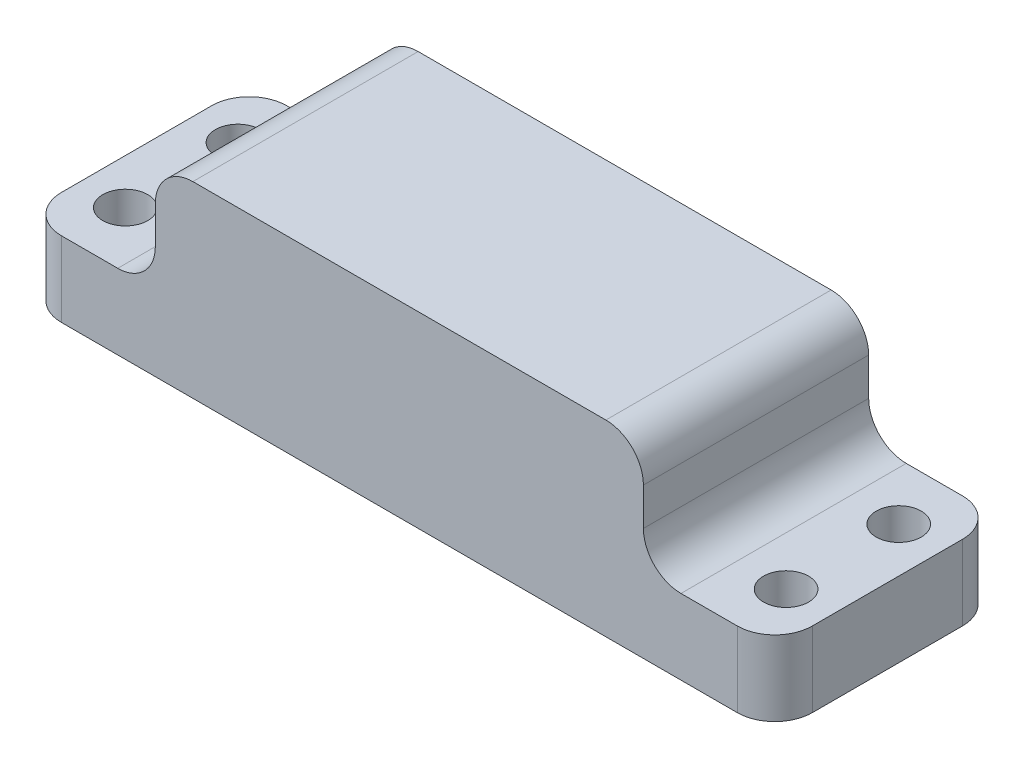
ISO-10303-21;
HEADER;
FILE_DESCRIPTION(('STEP AP214'),'2;1');
FILE_NAME('part.step','',(''),(''),'','','');
FILE_SCHEMA(('AUTOMOTIVE_DESIGN { 1 0 10303 214 1 1 1 1 }'));
ENDSEC;
DATA;
#1=APPLICATION_CONTEXT('core data for automotive mechanical design processes');
#2=APPLICATION_PROTOCOL_DEFINITION('international standard','automotive_design',2000,#1);
#3=PRODUCT_CONTEXT('',#1,'mechanical');
#4=PRODUCT('Part','Part','',(#3));
#5=PRODUCT_RELATED_PRODUCT_CATEGORY('part','',(#4));
#6=PRODUCT_DEFINITION_FORMATION('','',#4);
#7=PRODUCT_DEFINITION_CONTEXT('part definition',#1,'design');
#8=PRODUCT_DEFINITION('design','',#6,#7);
#9=PRODUCT_DEFINITION_SHAPE('','',#8);
#10=(LENGTH_UNIT() NAMED_UNIT(*) SI_UNIT(.MILLI.,.METRE.));
#11=(NAMED_UNIT(*) PLANE_ANGLE_UNIT() SI_UNIT($,.RADIAN.));
#12=(NAMED_UNIT(*) SI_UNIT($,.STERADIAN.) SOLID_ANGLE_UNIT());
#13=UNCERTAINTY_MEASURE_WITH_UNIT(LENGTH_MEASURE(1.E-05),#10,'distance_accuracy_value','');
#14=(GEOMETRIC_REPRESENTATION_CONTEXT(3) GLOBAL_UNCERTAINTY_ASSIGNED_CONTEXT((#13)) GLOBAL_UNIT_ASSIGNED_CONTEXT((#10,
#11,#12)) REPRESENTATION_CONTEXT('',''));
#15=CARTESIAN_POINT('',(0.,0.,0.));
#16=DIRECTION('',(0.,0.,1.));
#17=DIRECTION('',(1.,0.,0.));
#18=AXIS2_PLACEMENT_3D('',#15,#16,#17);
#19=CARTESIAN_POINT('',(-67.372881355932,54.5762711864407,60.));
#20=DIRECTION('',(0.,0.,-1.));
#21=DIRECTION('',(-1.,0.,0.));
#22=AXIS2_PLACEMENT_3D('',#19,#20,#21);
#23=CYLINDRICAL_SURFACE('',#22,9.99999999999999);
#24=CARTESIAN_POINT('',(-67.372881355932,54.5762711864407,0.));
#25=DIRECTION('',(0.,0.,1.));
#26=DIRECTION('',(1.,0.,0.));
#27=AXIS2_PLACEMENT_3D('',#24,#25,#26);
#28=CIRCLE('',#27,9.99999999999999);
#29=CARTESIAN_POINT('',(-67.372881355932,64.5762711864407,0.));
#30=VERTEX_POINT('',#29);
#31=CARTESIAN_POINT('',(-77.372881355932,54.5762711864407,0.));
#32=VERTEX_POINT('',#31);
#33=EDGE_CURVE('E176',#30,#32,#28,.T.);
#34=ORIENTED_EDGE('',*,*,#33,.T.);
#35=DIRECTION('',(0.,0.,-1.));
#36=VECTOR('',#35,1.);
#37=CARTESIAN_POINT('',(-77.372881355932,54.5762711864407,60.));
#38=LINE('',#37,#36);
#39=CARTESIAN_POINT('',(-77.372881355932,54.5762711864407,60.));
#40=VERTEX_POINT('',#39);
#41=EDGE_CURVE('E174',#40,#32,#38,.T.);
#42=ORIENTED_EDGE('',*,*,#41,.F.);
#43=CARTESIAN_POINT('',(-67.372881355932,54.5762711864407,60.));
#44=DIRECTION('',(0.,0.,1.));
#45=DIRECTION('',(1.,0.,0.));
#46=AXIS2_PLACEMENT_3D('',#43,#44,#45);
#47=CIRCLE('',#46,9.99999999999999);
#48=CARTESIAN_POINT('',(-67.372881355932,64.5762711864407,60.));
#49=VERTEX_POINT('',#48);
#50=EDGE_CURVE('E158',#49,#40,#47,.T.);
#51=ORIENTED_EDGE('',*,*,#50,.F.);
#52=DIRECTION('',(0.,0.,-1.));
#53=VECTOR('',#52,1.);
#54=CARTESIAN_POINT('',(-67.372881355932,64.5762711864407,60.));
#55=LINE('',#54,#53);
#56=EDGE_CURVE('E216',#49,#30,#55,.T.);
#57=ORIENTED_EDGE('',*,*,#56,.T.);
#58=EDGE_LOOP('',(#34,#42,#51,#57));
#59=FACE_BOUND('',#58,.T.);
#60=ADVANCED_FACE('F43',(#59),#23,.T.);
#61=CARTESIAN_POINT('',(-77.372881355932,44.5762711864408,60.));
#62=DIRECTION('',(-1.,0.,0.));
#63=DIRECTION('',(0.,0.,1.));
#64=AXIS2_PLACEMENT_3D('',#61,#62,#63);
#65=PLANE('',#64);
#66=DIRECTION('',(0.,1.,0.));
#67=VECTOR('',#66,1.);
#68=CARTESIAN_POINT('',(-77.372881355932,44.5762711864408,0.));
#69=LINE('',#68,#67);
#70=CARTESIAN_POINT('',(-77.372881355932,44.5762711864407,0.));
#71=VERTEX_POINT('',#70);
#72=EDGE_CURVE('E219',#71,#32,#69,.T.);
#73=ORIENTED_EDGE('',*,*,#72,.F.);
#74=DIRECTION('',(0.,0.,-1.));
#75=VECTOR('',#74,1.);
#76=CARTESIAN_POINT('',(-77.372881355932,44.5762711864407,60.));
#77=LINE('',#76,#75);
#78=CARTESIAN_POINT('',(-77.372881355932,44.5762711864407,60.));
#79=VERTEX_POINT('',#78);
#80=EDGE_CURVE('E182',#79,#71,#77,.T.);
#81=ORIENTED_EDGE('',*,*,#80,.F.);
#82=DIRECTION('',(0.,1.,0.));
#83=VECTOR('',#82,1.);
#84=CARTESIAN_POINT('',(-77.372881355932,44.5762711864408,60.));
#85=LINE('',#84,#83);
#86=EDGE_CURVE('E164',#79,#40,#85,.T.);
#87=ORIENTED_EDGE('',*,*,#86,.T.);
#88=ORIENTED_EDGE('',*,*,#41,.T.);
#89=EDGE_LOOP('',(#73,#81,#87,#88));
#90=FACE_BOUND('',#89,.T.);
#91=ADVANCED_FACE('F184',(#90),#65,.T.);
#92=CARTESIAN_POINT('',(-87.372881355932,44.5762711864407,60.));
#93=DIRECTION('',(0.,0.,-1.));
#94=DIRECTION('',(-1.,0.,0.));
#95=AXIS2_PLACEMENT_3D('',#92,#93,#94);
#96=CYLINDRICAL_SURFACE('',#95,10.);
#97=CARTESIAN_POINT('',(-87.372881355932,44.5762711864407,0.));
#98=DIRECTION('',(0.,0.,1.));
#99=DIRECTION('',(1.,0.,0.));
#100=AXIS2_PLACEMENT_3D('',#97,#98,#99);
#101=CIRCLE('',#100,10.);
#102=CARTESIAN_POINT('',(-87.3728813559321,34.5762711864407,0.));
#103=VERTEX_POINT('',#102);
#104=EDGE_CURVE('E223',#103,#71,#101,.T.);
#105=ORIENTED_EDGE('',*,*,#104,.F.);
#106=DIRECTION('',(0.,0.,-1.));
#107=VECTOR('',#106,1.);
#108=CARTESIAN_POINT('',(-87.3728813559321,34.5762711864407,60.));
#109=LINE('',#108,#107);
#110=CARTESIAN_POINT('',(-87.3728813559321,34.5762711864407,60.));
#111=VERTEX_POINT('',#110);
#112=EDGE_CURVE('E281',#111,#103,#109,.T.);
#113=ORIENTED_EDGE('',*,*,#112,.F.);
#114=CARTESIAN_POINT('',(-87.372881355932,44.5762711864407,60.));
#115=DIRECTION('',(0.,0.,1.));
#116=DIRECTION('',(1.,0.,0.));
#117=AXIS2_PLACEMENT_3D('',#114,#115,#116);
#118=CIRCLE('',#117,10.);
#119=EDGE_CURVE('E186',#111,#79,#118,.T.);
#120=ORIENTED_EDGE('',*,*,#119,.T.);
#121=ORIENTED_EDGE('',*,*,#80,.T.);
#122=EDGE_LOOP('',(#105,#113,#120,#121));
#123=FACE_BOUND('',#122,.T.);
#124=ADVANCED_FACE('F368',(#123),#96,.F.);
#125=CARTESIAN_POINT('',(-112.372881355932,34.5762711864407,60.));
#126=DIRECTION('',(0.,1.,0.));
#127=DIRECTION('',(0.,0.,1.));
#128=AXIS2_PLACEMENT_3D('',#125,#126,#127);
#129=PLANE('',#128);
#130=CARTESIAN_POINT('',(-100.372881355932,34.5762711864407,15.));
#131=DIRECTION('',(0.,1.,0.));
#132=DIRECTION('',(0.,0.,1.));
#133=AXIS2_PLACEMENT_3D('',#130,#131,#132);
#134=CIRCLE('',#133,5.99999999999999);
#135=CARTESIAN_POINT('',(-100.372881355932,34.5762711864407,21.));
#136=VERTEX_POINT('',#135);
#137=EDGE_CURVE('E512',#136,#136,#134,.T.);
#138=ORIENTED_EDGE('',*,*,#137,.F.);
#139=EDGE_LOOP('',(#138));
#140=FACE_BOUND('',#139,.T.);
#141=CARTESIAN_POINT('',(-100.372881355932,34.5762711864407,45.));
#142=DIRECTION('',(0.,1.,0.));
#143=DIRECTION('',(0.,0.,1.));
#144=AXIS2_PLACEMENT_3D('',#141,#142,#143);
#145=CIRCLE('',#144,5.99999999999999);
#146=CARTESIAN_POINT('',(-100.372881355932,34.5762711864407,51.));
#147=VERTEX_POINT('',#146);
#148=EDGE_CURVE('E498',#147,#147,#145,.T.);
#149=ORIENTED_EDGE('',*,*,#148,.F.);
#150=EDGE_LOOP('',(#149));
#151=FACE_BOUND('',#150,.T.);
#152=DIRECTION('',(1.,0.,0.));
#153=VECTOR('',#152,1.);
#154=CARTESIAN_POINT('',(-112.372881355932,34.5762711864407,0.));
#155=LINE('',#154,#153);
#156=CARTESIAN_POINT('',(-102.372881355932,34.5762711864407,0.));
#157=VERTEX_POINT('',#156);
#158=EDGE_CURVE('E227',#157,#103,#155,.T.);
#159=ORIENTED_EDGE('',*,*,#158,.F.);
#160=CARTESIAN_POINT('',(-102.372881355932,34.5762711864407,10.));
#161=DIRECTION('',(0.,1.,0.));
#162=DIRECTION('',(0.,0.,1.));
#163=AXIS2_PLACEMENT_3D('',#160,#161,#162);
#164=CIRCLE('',#163,10.);
#165=CARTESIAN_POINT('',(-112.372881355932,34.5762711864407,10.));
#166=VERTEX_POINT('',#165);
#167=EDGE_CURVE('E297',#157,#166,#164,.T.);
#168=ORIENTED_EDGE('',*,*,#167,.T.);
#169=DIRECTION('',(0.,0.,-1.));
#170=VECTOR('',#169,1.);
#171=CARTESIAN_POINT('',(-112.372881355932,34.5762711864407,60.));
#172=LINE('',#171,#170);
#173=CARTESIAN_POINT('',(-112.372881355932,34.5762711864407,50.));
#174=VERTEX_POINT('',#173);
#175=EDGE_CURVE('E277',#174,#166,#172,.T.);
#176=ORIENTED_EDGE('',*,*,#175,.F.);
#177=CARTESIAN_POINT('',(-102.372881355932,34.5762711864407,50.));
#178=DIRECTION('',(0.,1.,0.));
#179=DIRECTION('',(0.,0.,1.));
#180=AXIS2_PLACEMENT_3D('',#177,#178,#179);
#181=CIRCLE('',#180,10.);
#182=CARTESIAN_POINT('',(-102.372881355932,34.5762711864407,60.));
#183=VERTEX_POINT('',#182);
#184=EDGE_CURVE('E294',#174,#183,#181,.T.);
#185=ORIENTED_EDGE('',*,*,#184,.T.);
#186=DIRECTION('',(1.,0.,0.));
#187=VECTOR('',#186,1.);
#188=CARTESIAN_POINT('',(-112.372881355932,34.5762711864407,60.));
#189=LINE('',#188,#187);
#190=EDGE_CURVE('E189',#183,#111,#189,.T.);
#191=ORIENTED_EDGE('',*,*,#190,.T.);
#192=ORIENTED_EDGE('',*,*,#112,.T.);
#193=EDGE_LOOP('',(#159,#168,#176,#185,#191,#192));
#194=FACE_BOUND('',#193,.T.);
#195=ADVANCED_FACE('F383',(#140,#151,#194),#129,.T.);
#196=CARTESIAN_POINT('',(-112.372881355932,14.5762711864407,60.));
#197=DIRECTION('',(-1.,0.,0.));
#198=DIRECTION('',(0.,0.,1.));
#199=AXIS2_PLACEMENT_3D('',#196,#197,#198);
#200=PLANE('',#199);
#201=ORIENTED_EDGE('',*,*,#175,.T.);
#202=DIRECTION('',(0.,1.,0.));
#203=VECTOR('',#202,1.);
#204=CARTESIAN_POINT('',(-112.372881355932,14.5762711864407,10.));
#205=LINE('',#204,#203);
#206=CARTESIAN_POINT('',(-112.372881355932,14.5762711864407,10.));
#207=VERTEX_POINT('',#206);
#208=EDGE_CURVE('E304',#166,#207,#205,.F.);
#209=ORIENTED_EDGE('',*,*,#208,.T.);
#210=DIRECTION('',(0.,0.,-1.));
#211=VECTOR('',#210,1.);
#212=CARTESIAN_POINT('',(-112.372881355932,14.5762711864407,60.));
#213=LINE('',#212,#211);
#214=CARTESIAN_POINT('',(-112.372881355932,14.5762711864407,50.));
#215=VERTEX_POINT('',#214);
#216=EDGE_CURVE('E273',#215,#207,#213,.T.);
#217=ORIENTED_EDGE('',*,*,#216,.F.);
#218=DIRECTION('',(0.,1.,0.));
#219=VECTOR('',#218,1.);
#220=CARTESIAN_POINT('',(-112.372881355932,14.5762711864407,50.));
#221=LINE('',#220,#219);
#222=EDGE_CURVE('E300',#215,#174,#221,.T.);
#223=ORIENTED_EDGE('',*,*,#222,.T.);
#224=EDGE_LOOP('',(#201,#209,#217,#223));
#225=FACE_BOUND('',#224,.T.);
#226=ADVANCED_FACE('F378',(#225),#200,.T.);
#227=CARTESIAN_POINT('',(87.627118644068,14.5762711864407,60.));
#228=DIRECTION('',(0.,-1.,0.));
#229=DIRECTION('',(1.,0.,0.));
#230=AXIS2_PLACEMENT_3D('',#227,#228,#229);
#231=PLANE('',#230);
#232=CARTESIAN_POINT('',(-100.372881355932,14.5762711864407,15.));
#233=DIRECTION('',(0.,1.,0.));
#234=DIRECTION('',(0.,0.,1.));
#235=AXIS2_PLACEMENT_3D('',#232,#233,#234);
#236=CIRCLE('',#235,4.);
#237=CARTESIAN_POINT('',(-100.372881355932,14.5762711864407,19.));
#238=VERTEX_POINT('',#237);
#239=EDGE_CURVE('E450',#238,#238,#236,.T.);
#240=ORIENTED_EDGE('',*,*,#239,.T.);
#241=EDGE_LOOP('',(#240));
#242=FACE_BOUND('',#241,.T.);
#243=CARTESIAN_POINT('',(-100.372881355932,14.5762711864407,45.));
#244=DIRECTION('',(0.,1.,0.));
#245=DIRECTION('',(0.,0.,1.));
#246=AXIS2_PLACEMENT_3D('',#243,#244,#245);
#247=CIRCLE('',#246,4.);
#248=CARTESIAN_POINT('',(-100.372881355932,14.5762711864407,49.));
#249=VERTEX_POINT('',#248);
#250=EDGE_CURVE('E454',#249,#249,#247,.T.);
#251=ORIENTED_EDGE('',*,*,#250,.T.);
#252=EDGE_LOOP('',(#251));
#253=FACE_BOUND('',#252,.T.);
#254=CARTESIAN_POINT('',(75.6271186440679,14.5762711864407,15.));
#255=DIRECTION('',(0.,1.,0.));
#256=DIRECTION('',(0.,0.,1.));
#257=AXIS2_PLACEMENT_3D('',#254,#255,#256);
#258=CIRCLE('',#257,4.);
#259=CARTESIAN_POINT('',(75.6271186440679,14.5762711864407,19.));
#260=VERTEX_POINT('',#259);
#261=EDGE_CURVE('E458',#260,#260,#258,.T.);
#262=ORIENTED_EDGE('',*,*,#261,.T.);
#263=EDGE_LOOP('',(#262));
#264=FACE_BOUND('',#263,.T.);
#265=CARTESIAN_POINT('',(75.627118644068,14.5762711864407,45.));
#266=DIRECTION('',(0.,1.,0.));
#267=DIRECTION('',(0.,0.,1.));
#268=AXIS2_PLACEMENT_3D('',#265,#266,#267);
#269=CIRCLE('',#268,4.);
#270=CARTESIAN_POINT('',(75.627118644068,14.5762711864407,49.));
#271=VERTEX_POINT('',#270);
#272=EDGE_CURVE('E220',#271,#271,#269,.T.);
#273=ORIENTED_EDGE('',*,*,#272,.T.);
#274=EDGE_LOOP('',(#273));
#275=FACE_BOUND('',#274,.T.);
#276=ORIENTED_EDGE('',*,*,#216,.T.);
#277=CARTESIAN_POINT('',(-102.372881355932,14.5762711864407,10.));
#278=DIRECTION('',(0.,-1.,0.));
#279=DIRECTION('',(1.,0.,0.));
#280=AXIS2_PLACEMENT_3D('',#277,#278,#279);
#281=CIRCLE('',#280,10.);
#282=CARTESIAN_POINT('',(-102.372881355932,14.5762711864407,0.));
#283=VERTEX_POINT('',#282);
#284=EDGE_CURVE('E316',#207,#283,#281,.T.);
#285=ORIENTED_EDGE('',*,*,#284,.T.);
#286=DIRECTION('',(-1.,0.,0.));
#287=VECTOR('',#286,1.);
#288=CARTESIAN_POINT('',(87.627118644068,14.5762711864407,0.));
#289=LINE('',#288,#287);
#290=CARTESIAN_POINT('',(77.627118644068,14.5762711864407,0.));
#291=VERTEX_POINT('',#290);
#292=EDGE_CURVE('E230',#291,#283,#289,.T.);
#293=ORIENTED_EDGE('',*,*,#292,.F.);
#294=CARTESIAN_POINT('',(77.627118644068,14.5762711864407,10.));
#295=DIRECTION('',(0.,-1.,0.));
#296=DIRECTION('',(1.,0.,0.));
#297=AXIS2_PLACEMENT_3D('',#294,#295,#296);
#298=CIRCLE('',#297,10.);
#299=CARTESIAN_POINT('',(87.627118644068,14.5762711864407,10.));
#300=VERTEX_POINT('',#299);
#301=EDGE_CURVE('E310',#291,#300,#298,.T.);
#302=ORIENTED_EDGE('',*,*,#301,.T.);
#303=DIRECTION('',(0.,0.,-1.));
#304=VECTOR('',#303,1.);
#305=CARTESIAN_POINT('',(87.627118644068,14.5762711864407,60.));
#306=LINE('',#305,#304);
#307=CARTESIAN_POINT('',(87.627118644068,14.5762711864407,50.));
#308=VERTEX_POINT('',#307);
#309=EDGE_CURVE('E270',#308,#300,#306,.T.);
#310=ORIENTED_EDGE('',*,*,#309,.F.);
#311=CARTESIAN_POINT('',(77.627118644068,14.5762711864407,50.));
#312=DIRECTION('',(0.,-1.,0.));
#313=DIRECTION('',(1.,0.,0.));
#314=AXIS2_PLACEMENT_3D('',#311,#312,#313);
#315=CIRCLE('',#314,10.);
#316=CARTESIAN_POINT('',(77.627118644068,14.5762711864407,60.));
#317=VERTEX_POINT('',#316);
#318=EDGE_CURVE('E307',#308,#317,#315,.T.);
#319=ORIENTED_EDGE('',*,*,#318,.T.);
#320=DIRECTION('',(-1.,0.,0.));
#321=VECTOR('',#320,1.);
#322=CARTESIAN_POINT('',(87.627118644068,14.5762711864407,60.));
#323=LINE('',#322,#321);
#324=CARTESIAN_POINT('',(-102.372881355932,14.5762711864407,60.));
#325=VERTEX_POINT('',#324);
#326=EDGE_CURVE('E195',#317,#325,#323,.T.);
#327=ORIENTED_EDGE('',*,*,#326,.T.);
#328=CARTESIAN_POINT('',(-102.372881355932,14.5762711864407,50.));
#329=DIRECTION('',(0.,-1.,0.));
#330=DIRECTION('',(1.,0.,0.));
#331=AXIS2_PLACEMENT_3D('',#328,#329,#330);
#332=CIRCLE('',#331,10.);
#333=EDGE_CURVE('E313',#325,#215,#332,.T.);
#334=ORIENTED_EDGE('',*,*,#333,.T.);
#335=EDGE_LOOP('',(#276,#285,#293,#302,#310,#319,#327,#334));
#336=FACE_BOUND('',#335,.T.);
#337=ADVANCED_FACE('F336',(#242,#253,#264,#275,#336),#231,.T.);
#338=CARTESIAN_POINT('',(87.627118644068,34.5762711864407,60.));
#339=DIRECTION('',(1.,0.,0.));
#340=DIRECTION('',(0.,0.,-1.));
#341=AXIS2_PLACEMENT_3D('',#338,#339,#340);
#342=PLANE('',#341);
#343=ORIENTED_EDGE('',*,*,#309,.T.);
#344=DIRECTION('',(0.,-1.,0.));
#345=VECTOR('',#344,1.);
#346=CARTESIAN_POINT('',(87.627118644068,34.5762711864407,10.));
#347=LINE('',#346,#345);
#348=CARTESIAN_POINT('',(87.627118644068,34.5762711864407,10.));
#349=VERTEX_POINT('',#348);
#350=EDGE_CURVE('E59',#300,#349,#347,.F.);
#351=ORIENTED_EDGE('',*,*,#350,.T.);
#352=DIRECTION('',(0.,0.,-1.));
#353=VECTOR('',#352,1.);
#354=CARTESIAN_POINT('',(87.627118644068,34.5762711864407,60.));
#355=LINE('',#354,#353);
#356=CARTESIAN_POINT('',(87.627118644068,34.5762711864407,50.));
#357=VERTEX_POINT('',#356);
#358=EDGE_CURVE('E267',#357,#349,#355,.T.);
#359=ORIENTED_EDGE('',*,*,#358,.F.);
#360=DIRECTION('',(0.,-1.,0.));
#361=VECTOR('',#360,1.);
#362=CARTESIAN_POINT('',(87.627118644068,34.5762711864407,50.));
#363=LINE('',#362,#361);
#364=EDGE_CURVE('E325',#357,#308,#363,.T.);
#365=ORIENTED_EDGE('',*,*,#364,.T.);
#366=EDGE_LOOP('',(#343,#351,#359,#365));
#367=FACE_BOUND('',#366,.T.);
#368=ADVANCED_FACE('F333',(#367),#342,.T.);
#369=CARTESIAN_POINT('',(62.6271186440681,34.5762711864407,60.));
#370=DIRECTION('',(0.,1.,0.));
#371=DIRECTION('',(0.,0.,1.));
#372=AXIS2_PLACEMENT_3D('',#369,#370,#371);
#373=PLANE('',#372);
#374=CARTESIAN_POINT('',(75.6271186440679,34.5762711864407,15.));
#375=DIRECTION('',(0.,1.,0.));
#376=DIRECTION('',(0.,0.,1.));
#377=AXIS2_PLACEMENT_3D('',#374,#375,#376);
#378=CIRCLE('',#377,5.99999999999999);
#379=CARTESIAN_POINT('',(75.6271186440679,34.5762711864407,21.));
#380=VERTEX_POINT('',#379);
#381=EDGE_CURVE('E484',#380,#380,#378,.T.);
#382=ORIENTED_EDGE('',*,*,#381,.F.);
#383=EDGE_LOOP('',(#382));
#384=FACE_BOUND('',#383,.T.);
#385=CARTESIAN_POINT('',(75.627118644068,34.5762711864407,45.));
#386=DIRECTION('',(0.,1.,0.));
#387=DIRECTION('',(0.,0.,1.));
#388=AXIS2_PLACEMENT_3D('',#385,#386,#387);
#389=CIRCLE('',#388,5.99999999999999);
#390=CARTESIAN_POINT('',(75.627118644068,34.5762711864407,51.));
#391=VERTEX_POINT('',#390);
#392=EDGE_CURVE('E470',#391,#391,#389,.T.);
#393=ORIENTED_EDGE('',*,*,#392,.F.);
#394=EDGE_LOOP('',(#393));
#395=FACE_BOUND('',#394,.T.);
#396=ORIENTED_EDGE('',*,*,#358,.T.);
#397=CARTESIAN_POINT('',(77.627118644068,34.5762711864407,10.));
#398=DIRECTION('',(0.,1.,0.));
#399=DIRECTION('',(0.,0.,1.));
#400=AXIS2_PLACEMENT_3D('',#397,#398,#399);
#401=CIRCLE('',#400,10.);
#402=CARTESIAN_POINT('',(77.627118644068,34.5762711864407,0.));
#403=VERTEX_POINT('',#402);
#404=EDGE_CURVE('E11',#349,#403,#401,.T.);
#405=ORIENTED_EDGE('',*,*,#404,.T.);
#406=DIRECTION('',(1.,0.,0.));
#407=VECTOR('',#406,1.);
#408=CARTESIAN_POINT('',(62.6271186440681,34.5762711864407,0.));
#409=LINE('',#408,#407);
#410=CARTESIAN_POINT('',(62.6271186440681,34.5762711864408,0.));
#411=VERTEX_POINT('',#410);
#412=EDGE_CURVE('E234',#411,#403,#409,.T.);
#413=ORIENTED_EDGE('',*,*,#412,.F.);
#414=DIRECTION('',(0.,0.,-1.));
#415=VECTOR('',#414,1.);
#416=CARTESIAN_POINT('',(62.6271186440681,34.5762711864408,60.));
#417=LINE('',#416,#415);
#418=CARTESIAN_POINT('',(62.6271186440681,34.5762711864408,60.));
#419=VERTEX_POINT('',#418);
#420=EDGE_CURVE('E264',#419,#411,#417,.T.);
#421=ORIENTED_EDGE('',*,*,#420,.F.);
#422=DIRECTION('',(1.,0.,0.));
#423=VECTOR('',#422,1.);
#424=CARTESIAN_POINT('',(62.6271186440681,34.5762711864407,60.));
#425=LINE('',#424,#423);
#426=CARTESIAN_POINT('',(77.627118644068,34.5762711864407,60.));
#427=VERTEX_POINT('',#426);
#428=EDGE_CURVE('E199',#419,#427,#425,.T.);
#429=ORIENTED_EDGE('',*,*,#428,.T.);
#430=CARTESIAN_POINT('',(77.627118644068,34.5762711864407,50.));
#431=DIRECTION('',(0.,1.,0.));
#432=DIRECTION('',(0.,0.,1.));
#433=AXIS2_PLACEMENT_3D('',#430,#431,#432);
#434=CIRCLE('',#433,10.);
#435=EDGE_CURVE('E52',#427,#357,#434,.T.);
#436=ORIENTED_EDGE('',*,*,#435,.T.);
#437=EDGE_LOOP('',(#396,#405,#413,#421,#429,#436));
#438=FACE_BOUND('',#437,.T.);
#439=ADVANCED_FACE('F348',(#384,#395,#438),#373,.T.);
#440=CARTESIAN_POINT('',(62.627118644068,44.5762711864407,60.));
#441=DIRECTION('',(0.,0.,-1.));
#442=DIRECTION('',(-1.,0.,0.));
#443=AXIS2_PLACEMENT_3D('',#440,#441,#442);
#444=CYLINDRICAL_SURFACE('',#443,10.);
#445=CARTESIAN_POINT('',(62.627118644068,44.5762711864407,0.));
#446=DIRECTION('',(0.,0.,1.));
#447=DIRECTION('',(1.,0.,0.));
#448=AXIS2_PLACEMENT_3D('',#445,#446,#447);
#449=CIRCLE('',#448,10.);
#450=CARTESIAN_POINT('',(52.627118644068,44.5762711864408,0.));
#451=VERTEX_POINT('',#450);
#452=EDGE_CURVE('E238',#451,#411,#449,.T.);
#453=ORIENTED_EDGE('',*,*,#452,.F.);
#454=DIRECTION('',(0.,0.,-1.));
#455=VECTOR('',#454,1.);
#456=CARTESIAN_POINT('',(52.627118644068,44.5762711864408,60.));
#457=LINE('',#456,#455);
#458=CARTESIAN_POINT('',(52.627118644068,44.5762711864408,60.));
#459=VERTEX_POINT('',#458);
#460=EDGE_CURVE('E261',#459,#451,#457,.T.);
#461=ORIENTED_EDGE('',*,*,#460,.F.);
#462=CARTESIAN_POINT('',(62.627118644068,44.5762711864407,60.));
#463=DIRECTION('',(0.,0.,1.));
#464=DIRECTION('',(1.,0.,0.));
#465=AXIS2_PLACEMENT_3D('',#462,#463,#464);
#466=CIRCLE('',#465,10.);
#467=EDGE_CURVE('E202',#459,#419,#466,.T.);
#468=ORIENTED_EDGE('',*,*,#467,.T.);
#469=ORIENTED_EDGE('',*,*,#420,.T.);
#470=EDGE_LOOP('',(#453,#461,#468,#469));
#471=FACE_BOUND('',#470,.T.);
#472=ADVANCED_FACE('F354',(#471),#444,.F.);
#473=CARTESIAN_POINT('',(52.627118644068,54.5762711864407,60.));
#474=DIRECTION('',(1.,0.,0.));
#475=DIRECTION('',(0.,0.,-1.));
#476=AXIS2_PLACEMENT_3D('',#473,#474,#475);
#477=PLANE('',#476);
#478=DIRECTION('',(0.,-1.,0.));
#479=VECTOR('',#478,1.);
#480=CARTESIAN_POINT('',(52.627118644068,54.5762711864407,0.));
#481=LINE('',#480,#479);
#482=CARTESIAN_POINT('',(52.627118644068,54.5762711864407,0.));
#483=VERTEX_POINT('',#482);
#484=EDGE_CURVE('E242',#483,#451,#481,.T.);
#485=ORIENTED_EDGE('',*,*,#484,.F.);
#486=DIRECTION('',(0.,0.,-1.));
#487=VECTOR('',#486,1.);
#488=CARTESIAN_POINT('',(52.627118644068,54.5762711864407,60.));
#489=LINE('',#488,#487);
#490=CARTESIAN_POINT('',(52.627118644068,54.5762711864407,60.));
#491=VERTEX_POINT('',#490);
#492=EDGE_CURVE('E258',#491,#483,#489,.T.);
#493=ORIENTED_EDGE('',*,*,#492,.F.);
#494=DIRECTION('',(0.,-1.,0.));
#495=VECTOR('',#494,1.);
#496=CARTESIAN_POINT('',(52.627118644068,54.5762711864407,60.));
#497=LINE('',#496,#495);
#498=EDGE_CURVE('E206',#491,#459,#497,.T.);
#499=ORIENTED_EDGE('',*,*,#498,.T.);
#500=ORIENTED_EDGE('',*,*,#460,.T.);
#501=EDGE_LOOP('',(#485,#493,#499,#500));
#502=FACE_BOUND('',#501,.T.);
#503=ADVANCED_FACE('F357',(#502),#477,.T.);
#504=CARTESIAN_POINT('',(42.627118644068,54.5762711864407,60.));
#505=DIRECTION('',(0.,0.,-1.));
#506=DIRECTION('',(-1.,0.,0.));
#507=AXIS2_PLACEMENT_3D('',#504,#505,#506);
#508=CYLINDRICAL_SURFACE('',#507,9.99999999999999);
#509=CARTESIAN_POINT('',(42.627118644068,54.5762711864407,0.));
#510=DIRECTION('',(0.,0.,-1.));
#511=DIRECTION('',(-1.,0.,0.));
#512=AXIS2_PLACEMENT_3D('',#509,#510,#511);
#513=CIRCLE('',#512,9.99999999999999);
#514=CARTESIAN_POINT('',(42.6271186440679,64.5762711864407,0.));
#515=VERTEX_POINT('',#514);
#516=EDGE_CURVE('E246',#515,#483,#513,.T.);
#517=ORIENTED_EDGE('',*,*,#516,.F.);
#518=DIRECTION('',(0.,0.,-1.));
#519=VECTOR('',#518,1.);
#520=CARTESIAN_POINT('',(42.6271186440679,64.5762711864407,60.));
#521=LINE('',#520,#519);
#522=CARTESIAN_POINT('',(42.6271186440679,64.5762711864407,60.));
#523=VERTEX_POINT('',#522);
#524=EDGE_CURVE('E255',#523,#515,#521,.T.);
#525=ORIENTED_EDGE('',*,*,#524,.F.);
#526=CARTESIAN_POINT('',(42.627118644068,54.5762711864407,60.));
#527=DIRECTION('',(0.,0.,-1.));
#528=DIRECTION('',(-1.,0.,0.));
#529=AXIS2_PLACEMENT_3D('',#526,#527,#528);
#530=CIRCLE('',#529,9.99999999999999);
#531=EDGE_CURVE('E210',#523,#491,#530,.T.);
#532=ORIENTED_EDGE('',*,*,#531,.T.);
#533=ORIENTED_EDGE('',*,*,#492,.T.);
#534=EDGE_LOOP('',(#517,#525,#532,#533));
#535=FACE_BOUND('',#534,.T.);
#536=ADVANCED_FACE('F360',(#535),#508,.T.);
#537=CARTESIAN_POINT('',(-67.372881355932,64.5762711864407,60.));
#538=DIRECTION('',(0.,1.,0.));
#539=DIRECTION('',(0.,0.,1.));
#540=AXIS2_PLACEMENT_3D('',#537,#538,#539);
#541=PLANE('',#540);
#542=DIRECTION('',(1.,0.,0.));
#543=VECTOR('',#542,1.);
#544=CARTESIAN_POINT('',(-67.372881355932,64.5762711864407,0.));
#545=LINE('',#544,#543);
#546=EDGE_CURVE('E171',#30,#515,#545,.T.);
#547=ORIENTED_EDGE('',*,*,#546,.F.);
#548=ORIENTED_EDGE('',*,*,#56,.F.);
#549=DIRECTION('',(1.,0.,0.));
#550=VECTOR('',#549,1.);
#551=CARTESIAN_POINT('',(-67.372881355932,64.5762711864407,60.));
#552=LINE('',#551,#550);
#553=EDGE_CURVE('E168',#49,#523,#552,.T.);
#554=ORIENTED_EDGE('',*,*,#553,.T.);
#555=ORIENTED_EDGE('',*,*,#524,.T.);
#556=EDGE_LOOP('',(#547,#548,#554,#555));
#557=FACE_BOUND('',#556,.T.);
#558=ADVANCED_FACE('F363',(#557),#541,.T.);
#559=CARTESIAN_POINT('',(-67.372881355932,54.5762711864407,60.));
#560=DIRECTION('',(0.,0.,1.));
#561=DIRECTION('',(1.,0.,0.));
#562=AXIS2_PLACEMENT_3D('',#559,#560,#561);
#563=PLANE('',#562);
#564=ORIENTED_EDGE('',*,*,#190,.F.);
#565=DIRECTION('',(0.,1.,0.));
#566=VECTOR('',#565,1.);
#567=CARTESIAN_POINT('',(-102.372881355932,54.5762711864407,60.));
#568=LINE('',#567,#566);
#569=EDGE_CURVE('E322',#183,#325,#568,.F.);
#570=ORIENTED_EDGE('',*,*,#569,.T.);
#571=ORIENTED_EDGE('',*,*,#326,.F.);
#572=DIRECTION('',(0.,-1.,0.));
#573=VECTOR('',#572,1.);
#574=CARTESIAN_POINT('',(77.627118644068,54.5762711864407,60.));
#575=LINE('',#574,#573);
#576=EDGE_CURVE('E319',#317,#427,#575,.F.);
#577=ORIENTED_EDGE('',*,*,#576,.T.);
#578=ORIENTED_EDGE('',*,*,#428,.F.);
#579=ORIENTED_EDGE('',*,*,#467,.F.);
#580=ORIENTED_EDGE('',*,*,#498,.F.);
#581=ORIENTED_EDGE('',*,*,#531,.F.);
#582=ORIENTED_EDGE('',*,*,#553,.F.);
#583=ORIENTED_EDGE('',*,*,#50,.T.);
#584=ORIENTED_EDGE('',*,*,#86,.F.);
#585=ORIENTED_EDGE('',*,*,#119,.F.);
#586=EDGE_LOOP('',(#564,#570,#571,#577,#578,#579,#580,#581,#582,#583,#584,#585));
#587=FACE_BOUND('',#586,.T.);
#588=ADVANCED_FACE('F161',(#587),#563,.T.);
#589=CARTESIAN_POINT('',(-67.372881355932,54.5762711864407,0.));
#590=DIRECTION('',(0.,0.,1.));
#591=DIRECTION('',(1.,0.,0.));
#592=AXIS2_PLACEMENT_3D('',#589,#590,#591);
#593=PLANE('',#592);
#594=ORIENTED_EDGE('',*,*,#292,.T.);
#595=DIRECTION('',(0.,1.,0.));
#596=VECTOR('',#595,1.);
#597=CARTESIAN_POINT('',(-102.372881355932,34.5762711864407,0.));
#598=LINE('',#597,#596);
#599=EDGE_CURVE('E290',#283,#157,#598,.T.);
#600=ORIENTED_EDGE('',*,*,#599,.T.);
#601=ORIENTED_EDGE('',*,*,#158,.T.);
#602=ORIENTED_EDGE('',*,*,#104,.T.);
#603=ORIENTED_EDGE('',*,*,#72,.T.);
#604=ORIENTED_EDGE('',*,*,#33,.F.);
#605=ORIENTED_EDGE('',*,*,#546,.T.);
#606=ORIENTED_EDGE('',*,*,#516,.T.);
#607=ORIENTED_EDGE('',*,*,#484,.T.);
#608=ORIENTED_EDGE('',*,*,#452,.T.);
#609=ORIENTED_EDGE('',*,*,#412,.T.);
#610=DIRECTION('',(0.,-1.,0.));
#611=VECTOR('',#610,1.);
#612=CARTESIAN_POINT('',(77.627118644068,14.5762711864407,0.));
#613=LINE('',#612,#611);
#614=EDGE_CURVE('E181',#403,#291,#613,.T.);
#615=ORIENTED_EDGE('',*,*,#614,.T.);
#616=EDGE_LOOP('',(#594,#600,#601,#602,#603,#604,#605,#606,#607,#608,#609,#615));
#617=FACE_BOUND('',#616,.T.);
#618=ADVANCED_FACE('F344',(#617),#593,.F.);
#619=CARTESIAN_POINT('',(-102.372881355932,54.5762711864407,10.));
#620=DIRECTION('',(0.,-1.,0.));
#621=DIRECTION('',(0.,0.,-1.));
#622=AXIS2_PLACEMENT_3D('',#619,#620,#621);
#623=CYLINDRICAL_SURFACE('',#622,10.);
#624=ORIENTED_EDGE('',*,*,#284,.F.);
#625=ORIENTED_EDGE('',*,*,#208,.F.);
#626=ORIENTED_EDGE('',*,*,#167,.F.);
#627=ORIENTED_EDGE('',*,*,#599,.F.);
#628=EDGE_LOOP('',(#624,#625,#626,#627));
#629=FACE_BOUND('',#628,.T.);
#630=ADVANCED_FACE('F382',(#629),#623,.T.);
#631=CARTESIAN_POINT('',(-102.372881355932,14.5762711864407,50.));
#632=DIRECTION('',(0.,1.,0.));
#633=DIRECTION('',(0.,0.,1.));
#634=AXIS2_PLACEMENT_3D('',#631,#632,#633);
#635=CYLINDRICAL_SURFACE('',#634,10.);
#636=ORIENTED_EDGE('',*,*,#333,.F.);
#637=ORIENTED_EDGE('',*,*,#569,.F.);
#638=ORIENTED_EDGE('',*,*,#184,.F.);
#639=ORIENTED_EDGE('',*,*,#222,.F.);
#640=EDGE_LOOP('',(#636,#637,#638,#639));
#641=FACE_BOUND('',#640,.T.);
#642=ADVANCED_FACE('F373',(#641),#635,.T.);
#643=CARTESIAN_POINT('',(77.627118644068,54.5762711864407,10.));
#644=DIRECTION('',(0.,1.,0.));
#645=DIRECTION('',(0.,0.,1.));
#646=AXIS2_PLACEMENT_3D('',#643,#644,#645);
#647=CYLINDRICAL_SURFACE('',#646,10.);
#648=ORIENTED_EDGE('',*,*,#404,.F.);
#649=ORIENTED_EDGE('',*,*,#350,.F.);
#650=ORIENTED_EDGE('',*,*,#301,.F.);
#651=ORIENTED_EDGE('',*,*,#614,.F.);
#652=EDGE_LOOP('',(#648,#649,#650,#651));
#653=FACE_BOUND('',#652,.T.);
#654=ADVANCED_FACE('F342',(#653),#647,.T.);
#655=CARTESIAN_POINT('',(77.627118644068,34.5762711864407,50.));
#656=DIRECTION('',(0.,-1.,0.));
#657=DIRECTION('',(0.,0.,-1.));
#658=AXIS2_PLACEMENT_3D('',#655,#656,#657);
#659=CYLINDRICAL_SURFACE('',#658,10.);
#660=ORIENTED_EDGE('',*,*,#435,.F.);
#661=ORIENTED_EDGE('',*,*,#576,.F.);
#662=ORIENTED_EDGE('',*,*,#318,.F.);
#663=ORIENTED_EDGE('',*,*,#364,.F.);
#664=EDGE_LOOP('',(#660,#661,#662,#663));
#665=FACE_BOUND('',#664,.T.);
#666=ADVANCED_FACE('F45',(#665),#659,.T.);
#667=CARTESIAN_POINT('',(75.627118644068,34.5762711864407,45.));
#668=DIRECTION('',(0.,1.,0.));
#669=DIRECTION('',(0.,0.,1.));
#670=AXIS2_PLACEMENT_3D('',#667,#668,#669);
#671=CYLINDRICAL_SURFACE('',#670,4.);
#672=ORIENTED_EDGE('',*,*,#272,.F.);
#673=EDGE_LOOP('',(#672));
#674=FACE_BOUND('',#673,.T.);
#675=CARTESIAN_POINT('',(75.627118644068,24.5762711864407,45.));
#676=DIRECTION('',(0.,1.,0.));
#677=DIRECTION('',(0.,0.,1.));
#678=AXIS2_PLACEMENT_3D('',#675,#676,#677);
#679=CIRCLE('',#678,4.);
#680=CARTESIAN_POINT('',(75.627118644068,24.5762711864407,49.));
#681=VERTEX_POINT('',#680);
#682=EDGE_CURVE('E461',#681,#681,#679,.T.);
#683=ORIENTED_EDGE('',*,*,#682,.T.);
#684=EDGE_LOOP('',(#683));
#685=FACE_BOUND('',#684,.T.);
#686=ADVANCED_FACE('F409',(#674,#685),#671,.F.);
#687=CARTESIAN_POINT('',(79.627118644068,24.5762711864407,45.));
#688=DIRECTION('',(0.,-1.,0.));
#689=DIRECTION('',(0.,0.,-1.));
#690=AXIS2_PLACEMENT_3D('',#687,#688,#689);
#691=PLANE('',#690);
#692=ORIENTED_EDGE('',*,*,#682,.F.);
#693=EDGE_LOOP('',(#692));
#694=FACE_BOUND('',#693,.T.);
#695=CARTESIAN_POINT('',(75.627118644068,24.5762711864407,45.));
#696=DIRECTION('',(0.,1.,0.));
#697=DIRECTION('',(0.,0.,1.));
#698=AXIS2_PLACEMENT_3D('',#695,#696,#697);
#699=CIRCLE('',#698,5.99999999999999);
#700=CARTESIAN_POINT('',(75.627118644068,24.5762711864407,51.));
#701=VERTEX_POINT('',#700);
#702=EDGE_CURVE('E464',#701,#701,#699,.T.);
#703=ORIENTED_EDGE('',*,*,#702,.T.);
#704=EDGE_LOOP('',(#703));
#705=FACE_BOUND('',#704,.T.);
#706=ADVANCED_FACE('F413',(#694,#705),#691,.F.);
#707=CARTESIAN_POINT('',(75.627118644068,34.5762711864407,45.));
#708=DIRECTION('',(0.,1.,0.));
#709=DIRECTION('',(0.,0.,1.));
#710=AXIS2_PLACEMENT_3D('',#707,#708,#709);
#711=CYLINDRICAL_SURFACE('',#710,5.99999999999999);
#712=ORIENTED_EDGE('',*,*,#702,.F.);
#713=EDGE_LOOP('',(#712));
#714=FACE_BOUND('',#713,.T.);
#715=ORIENTED_EDGE('',*,*,#392,.T.);
#716=EDGE_LOOP('',(#715));
#717=FACE_BOUND('',#716,.T.);
#718=ADVANCED_FACE('F419',(#714,#717),#711,.F.);
#719=CARTESIAN_POINT('',(75.6271186440679,34.5762711864407,15.));
#720=DIRECTION('',(0.,1.,0.));
#721=DIRECTION('',(0.,0.,1.));
#722=AXIS2_PLACEMENT_3D('',#719,#720,#721);
#723=CYLINDRICAL_SURFACE('',#722,4.);
#724=ORIENTED_EDGE('',*,*,#261,.F.);
#725=EDGE_LOOP('',(#724));
#726=FACE_BOUND('',#725,.T.);
#727=CARTESIAN_POINT('',(75.6271186440679,24.5762711864407,15.));
#728=DIRECTION('',(0.,1.,0.));
#729=DIRECTION('',(0.,0.,1.));
#730=AXIS2_PLACEMENT_3D('',#727,#728,#729);
#731=CIRCLE('',#730,4.);
#732=CARTESIAN_POINT('',(75.6271186440679,24.5762711864407,19.));
#733=VERTEX_POINT('',#732);
#734=EDGE_CURVE('E476',#733,#733,#731,.T.);
#735=ORIENTED_EDGE('',*,*,#734,.T.);
#736=EDGE_LOOP('',(#735));
#737=FACE_BOUND('',#736,.T.);
#738=ADVANCED_FACE('F551',(#726,#737),#723,.F.);
#739=CARTESIAN_POINT('',(79.6271186440679,24.5762711864407,15.));
#740=DIRECTION('',(0.,-1.,0.));
#741=DIRECTION('',(0.,0.,-1.));
#742=AXIS2_PLACEMENT_3D('',#739,#740,#741);
#743=PLANE('',#742);
#744=ORIENTED_EDGE('',*,*,#734,.F.);
#745=EDGE_LOOP('',(#744));
#746=FACE_BOUND('',#745,.T.);
#747=CARTESIAN_POINT('',(75.6271186440679,24.5762711864407,15.));
#748=DIRECTION('',(0.,1.,0.));
#749=DIRECTION('',(0.,0.,1.));
#750=AXIS2_PLACEMENT_3D('',#747,#748,#749);
#751=CIRCLE('',#750,5.99999999999999);
#752=CARTESIAN_POINT('',(75.6271186440679,24.5762711864407,21.));
#753=VERTEX_POINT('',#752);
#754=EDGE_CURVE('E480',#753,#753,#751,.T.);
#755=ORIENTED_EDGE('',*,*,#754,.T.);
#756=EDGE_LOOP('',(#755));
#757=FACE_BOUND('',#756,.T.);
#758=ADVANCED_FACE('F547',(#746,#757),#743,.F.);
#759=CARTESIAN_POINT('',(75.6271186440679,34.5762711864407,15.));
#760=DIRECTION('',(0.,1.,0.));
#761=DIRECTION('',(0.,0.,1.));
#762=AXIS2_PLACEMENT_3D('',#759,#760,#761);
#763=CYLINDRICAL_SURFACE('',#762,5.99999999999999);
#764=ORIENTED_EDGE('',*,*,#754,.F.);
#765=EDGE_LOOP('',(#764));
#766=FACE_BOUND('',#765,.T.);
#767=ORIENTED_EDGE('',*,*,#381,.T.);
#768=EDGE_LOOP('',(#767));
#769=FACE_BOUND('',#768,.T.);
#770=ADVANCED_FACE('F543',(#766,#769),#763,.F.);
#771=CARTESIAN_POINT('',(-100.372881355932,34.5762711864407,45.));
#772=DIRECTION('',(0.,1.,0.));
#773=DIRECTION('',(0.,0.,1.));
#774=AXIS2_PLACEMENT_3D('',#771,#772,#773);
#775=CYLINDRICAL_SURFACE('',#774,4.);
#776=ORIENTED_EDGE('',*,*,#250,.F.);
#777=EDGE_LOOP('',(#776));
#778=FACE_BOUND('',#777,.T.);
#779=CARTESIAN_POINT('',(-100.372881355932,24.5762711864407,45.));
#780=DIRECTION('',(0.,1.,0.));
#781=DIRECTION('',(0.,0.,1.));
#782=AXIS2_PLACEMENT_3D('',#779,#780,#781);
#783=CIRCLE('',#782,4.);
#784=CARTESIAN_POINT('',(-100.372881355932,24.5762711864407,49.));
#785=VERTEX_POINT('',#784);
#786=EDGE_CURVE('E490',#785,#785,#783,.T.);
#787=ORIENTED_EDGE('',*,*,#786,.T.);
#788=EDGE_LOOP('',(#787));
#789=FACE_BOUND('',#788,.T.);
#790=ADVANCED_FACE('F539',(#778,#789),#775,.F.);
#791=CARTESIAN_POINT('',(-96.372881355932,24.5762711864407,45.));
#792=DIRECTION('',(0.,-1.,0.));
#793=DIRECTION('',(0.,0.,-1.));
#794=AXIS2_PLACEMENT_3D('',#791,#792,#793);
#795=PLANE('',#794);
#796=ORIENTED_EDGE('',*,*,#786,.F.);
#797=EDGE_LOOP('',(#796));
#798=FACE_BOUND('',#797,.T.);
#799=CARTESIAN_POINT('',(-100.372881355932,24.5762711864407,45.));
#800=DIRECTION('',(0.,1.,0.));
#801=DIRECTION('',(0.,0.,1.));
#802=AXIS2_PLACEMENT_3D('',#799,#800,#801);
#803=CIRCLE('',#802,5.99999999999999);
#804=CARTESIAN_POINT('',(-100.372881355932,24.5762711864407,51.));
#805=VERTEX_POINT('',#804);
#806=EDGE_CURVE('E494',#805,#805,#803,.T.);
#807=ORIENTED_EDGE('',*,*,#806,.T.);
#808=EDGE_LOOP('',(#807));
#809=FACE_BOUND('',#808,.T.);
#810=ADVANCED_FACE('F535',(#798,#809),#795,.F.);
#811=CARTESIAN_POINT('',(-100.372881355932,34.5762711864407,45.));
#812=DIRECTION('',(0.,1.,0.));
#813=DIRECTION('',(0.,0.,1.));
#814=AXIS2_PLACEMENT_3D('',#811,#812,#813);
#815=CYLINDRICAL_SURFACE('',#814,5.99999999999999);
#816=ORIENTED_EDGE('',*,*,#806,.F.);
#817=EDGE_LOOP('',(#816));
#818=FACE_BOUND('',#817,.T.);
#819=ORIENTED_EDGE('',*,*,#148,.T.);
#820=EDGE_LOOP('',(#819));
#821=FACE_BOUND('',#820,.T.);
#822=ADVANCED_FACE('F531',(#818,#821),#815,.F.);
#823=CARTESIAN_POINT('',(-100.372881355932,34.5762711864407,15.));
#824=DIRECTION('',(0.,1.,0.));
#825=DIRECTION('',(0.,0.,1.));
#826=AXIS2_PLACEMENT_3D('',#823,#824,#825);
#827=CYLINDRICAL_SURFACE('',#826,4.);
#828=ORIENTED_EDGE('',*,*,#239,.F.);
#829=EDGE_LOOP('',(#828));
#830=FACE_BOUND('',#829,.T.);
#831=CARTESIAN_POINT('',(-100.372881355932,24.5762711864407,15.));
#832=DIRECTION('',(0.,1.,0.));
#833=DIRECTION('',(0.,0.,1.));
#834=AXIS2_PLACEMENT_3D('',#831,#832,#833);
#835=CIRCLE('',#834,4.);
#836=CARTESIAN_POINT('',(-100.372881355932,24.5762711864407,19.));
#837=VERTEX_POINT('',#836);
#838=EDGE_CURVE('E504',#837,#837,#835,.T.);
#839=ORIENTED_EDGE('',*,*,#838,.T.);
#840=EDGE_LOOP('',(#839));
#841=FACE_BOUND('',#840,.T.);
#842=ADVANCED_FACE('F524',(#830,#841),#827,.F.);
#843=CARTESIAN_POINT('',(-96.372881355932,24.5762711864407,15.));
#844=DIRECTION('',(0.,-1.,0.));
#845=DIRECTION('',(0.,0.,-1.));
#846=AXIS2_PLACEMENT_3D('',#843,#844,#845);
#847=PLANE('',#846);
#848=ORIENTED_EDGE('',*,*,#838,.F.);
#849=EDGE_LOOP('',(#848));
#850=FACE_BOUND('',#849,.T.);
#851=CARTESIAN_POINT('',(-100.372881355932,24.5762711864407,15.));
#852=DIRECTION('',(0.,1.,0.));
#853=DIRECTION('',(0.,0.,1.));
#854=AXIS2_PLACEMENT_3D('',#851,#852,#853);
#855=CIRCLE('',#854,5.99999999999999);
#856=CARTESIAN_POINT('',(-100.372881355932,24.5762711864407,21.));
#857=VERTEX_POINT('',#856);
#858=EDGE_CURVE('E508',#857,#857,#855,.T.);
#859=ORIENTED_EDGE('',*,*,#858,.T.);
#860=EDGE_LOOP('',(#859));
#861=FACE_BOUND('',#860,.T.);
#862=ADVANCED_FACE('F518',(#850,#861),#847,.F.);
#863=CARTESIAN_POINT('',(-100.372881355932,34.5762711864407,15.));
#864=DIRECTION('',(0.,1.,0.));
#865=DIRECTION('',(0.,0.,1.));
#866=AXIS2_PLACEMENT_3D('',#863,#864,#865);
#867=CYLINDRICAL_SURFACE('',#866,5.99999999999999);
#868=ORIENTED_EDGE('',*,*,#858,.F.);
#869=EDGE_LOOP('',(#868));
#870=FACE_BOUND('',#869,.T.);
#871=ORIENTED_EDGE('',*,*,#137,.T.);
#872=EDGE_LOOP('',(#871));
#873=FACE_BOUND('',#872,.T.);
#874=ADVANCED_FACE('F516',(#870,#873),#867,.F.);
#875=CLOSED_SHELL('',(#60,#91,#124,#195,#226,#337,#368,#439,#472,#503,#536,#558,#588,#618,#630,
#642,#654,#666,#686,#706,#718,#738,#758,#770,#790,#810,#822,#842,#862,#874));
#876=MANIFOLD_SOLID_BREP('B2',#875);
#877=ADVANCED_BREP_SHAPE_REPRESENTATION('',(#18,#876),#14);
#878=SHAPE_DEFINITION_REPRESENTATION(#9,#877);
ENDSEC;
END-ISO-10303-21;
